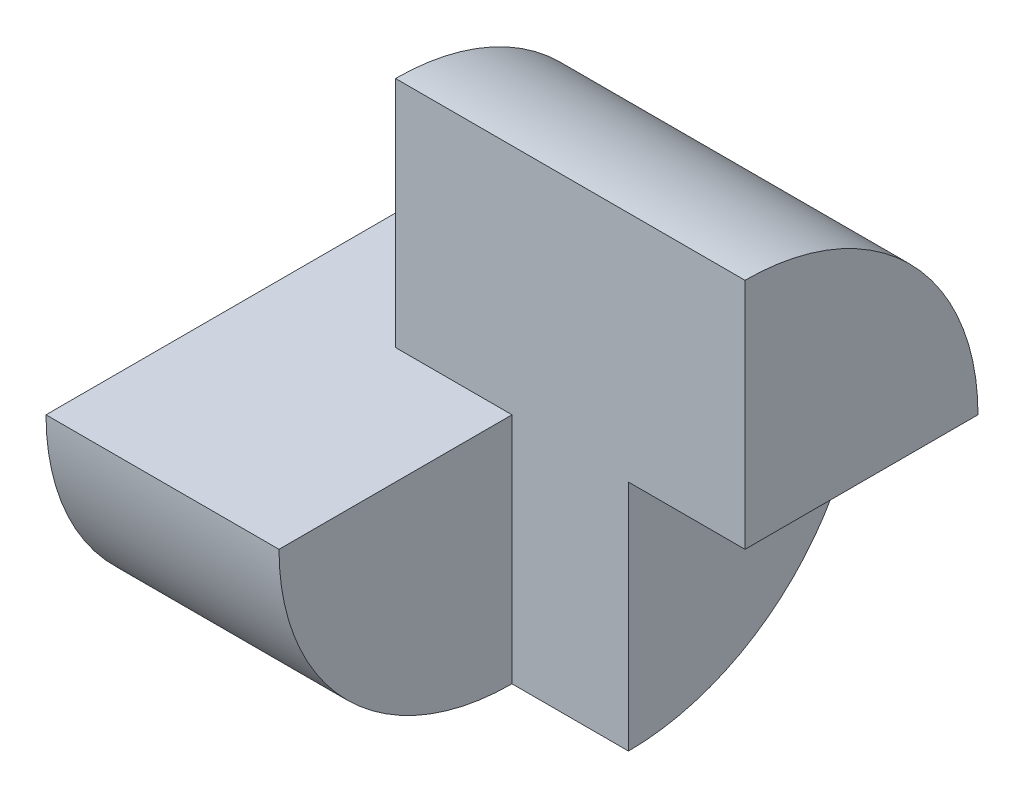
ISO-10303-21;
HEADER;
FILE_DESCRIPTION(('STEP AP214'),'2;1');
FILE_NAME('part.step','',(''),(''),'','','');
FILE_SCHEMA(('AUTOMOTIVE_DESIGN { 1 0 10303 214 1 1 1 1 }'));
ENDSEC;
DATA;
#1=APPLICATION_CONTEXT('core data for automotive mechanical design processes');
#2=APPLICATION_PROTOCOL_DEFINITION('international standard','automotive_design',2000,#1);
#3=PRODUCT_CONTEXT('',#1,'mechanical');
#4=PRODUCT('Part','Part','',(#3));
#5=PRODUCT_RELATED_PRODUCT_CATEGORY('part','',(#4));
#6=PRODUCT_DEFINITION_FORMATION('','',#4);
#7=PRODUCT_DEFINITION_CONTEXT('part definition',#1,'design');
#8=PRODUCT_DEFINITION('design','',#6,#7);
#9=PRODUCT_DEFINITION_SHAPE('','',#8);
#10=(LENGTH_UNIT() NAMED_UNIT(*) SI_UNIT(.MILLI.,.METRE.));
#11=(NAMED_UNIT(*) PLANE_ANGLE_UNIT() SI_UNIT($,.RADIAN.));
#12=(NAMED_UNIT(*) SI_UNIT($,.STERADIAN.) SOLID_ANGLE_UNIT());
#13=UNCERTAINTY_MEASURE_WITH_UNIT(LENGTH_MEASURE(1.E-05),#10,'distance_accuracy_value','');
#14=(GEOMETRIC_REPRESENTATION_CONTEXT(3) GLOBAL_UNCERTAINTY_ASSIGNED_CONTEXT((#13)) GLOBAL_UNIT_ASSIGNED_CONTEXT((#10,
#11,#12)) REPRESENTATION_CONTEXT('',''));
#15=CARTESIAN_POINT('',(0.,0.,0.));
#16=DIRECTION('',(0.,0.,1.));
#17=DIRECTION('',(1.,0.,0.));
#18=AXIS2_PLACEMENT_3D('',#15,#16,#17);
#19=CARTESIAN_POINT('',(0.,20.,0.));
#20=DIRECTION('',(0.,-1.,0.));
#21=DIRECTION('',(0.,0.,-1.));
#22=AXIS2_PLACEMENT_3D('',#19,#20,#21);
#23=PLANE('',#22);
#24=DIRECTION('',(0.,0.,1.));
#25=VECTOR('',#24,1.);
#26=CARTESIAN_POINT('',(20.,20.,40.));
#27=LINE('',#26,#25);
#28=CARTESIAN_POINT('',(20.,20.,20.));
#29=VERTEX_POINT('',#28);
#30=CARTESIAN_POINT('',(20.,20.,40.));
#31=VERTEX_POINT('',#30);
#32=EDGE_CURVE('E164',#29,#31,#27,.T.);
#33=ORIENTED_EDGE('',*,*,#32,.F.);
#34=DIRECTION('',(-1.,0.,0.));
#35=VECTOR('',#34,1.);
#36=CARTESIAN_POINT('',(50.,20.,20.));
#37=LINE('',#36,#35);
#38=CARTESIAN_POINT('',(10.,20.,20.));
#39=VERTEX_POINT('',#38);
#40=EDGE_CURVE('E149',#29,#39,#37,.T.);
#41=ORIENTED_EDGE('',*,*,#40,.T.);
#42=DIRECTION('',(0.,0.,1.));
#43=VECTOR('',#42,1.);
#44=CARTESIAN_POINT('',(10.,20.,0.));
#45=LINE('',#44,#43);
#46=CARTESIAN_POINT('',(10.,20.,0.));
#47=VERTEX_POINT('',#46);
#48=EDGE_CURVE('E127',#47,#39,#45,.T.);
#49=ORIENTED_EDGE('',*,*,#48,.F.);
#50=DIRECTION('',(1.,0.,0.));
#51=VECTOR('',#50,1.);
#52=CARTESIAN_POINT('',(0.,20.,0.));
#53=LINE('',#52,#51);
#54=CARTESIAN_POINT('',(0.,20.,0.));
#55=VERTEX_POINT('',#54);
#56=EDGE_CURVE('E123',#55,#47,#53,.T.);
#57=ORIENTED_EDGE('',*,*,#56,.F.);
#58=DIRECTION('',(0.,0.,1.));
#59=VECTOR('',#58,1.);
#60=CARTESIAN_POINT('',(0.,20.,0.));
#61=LINE('',#60,#59);
#62=CARTESIAN_POINT('',(0.,20.,40.));
#63=VERTEX_POINT('',#62);
#64=EDGE_CURVE('E110',#55,#63,#61,.T.);
#65=ORIENTED_EDGE('',*,*,#64,.T.);
#66=DIRECTION('',(1.,0.,0.));
#67=VECTOR('',#66,1.);
#68=CARTESIAN_POINT('',(0.,20.,40.));
#69=LINE('',#68,#67);
#70=EDGE_CURVE('E116',#63,#31,#69,.T.);
#71=ORIENTED_EDGE('',*,*,#70,.T.);
#72=EDGE_LOOP('',(#33,#41,#49,#57,#65,#71));
#73=FACE_BOUND('',#72,.T.);
#74=ADVANCED_FACE('F51',(#73),#23,.F.);
#75=CARTESIAN_POINT('',(0.,0.,40.));
#76=DIRECTION('',(1.,0.,0.));
#77=DIRECTION('',(0.,0.,-1.));
#78=AXIS2_PLACEMENT_3D('',#75,#76,#77);
#79=PLANE('',#78);
#80=CARTESIAN_POINT('',(0.,20.,20.));
#81=DIRECTION('',(-1.,0.,0.));
#82=DIRECTION('',(0.,0.,1.));
#83=AXIS2_PLACEMENT_3D('',#80,#81,#82);
#84=CIRCLE('',#83,20.);
#85=EDGE_CURVE('E107',#63,#55,#84,.F.);
#86=ORIENTED_EDGE('',*,*,#85,.F.);
#87=ORIENTED_EDGE('',*,*,#64,.F.);
#88=EDGE_LOOP('',(#86,#87));
#89=FACE_BOUND('',#88,.T.);
#90=ADVANCED_FACE('F53',(#89),#79,.F.);
#91=CARTESIAN_POINT('',(40.,0.,40.));
#92=DIRECTION('',(-1.,0.,0.));
#93=DIRECTION('',(0.,0.,1.));
#94=AXIS2_PLACEMENT_3D('',#91,#92,#93);
#95=PLANE('',#94);
#96=DIRECTION('',(0.,0.,1.));
#97=VECTOR('',#96,1.);
#98=CARTESIAN_POINT('',(40.,20.,0.));
#99=LINE('',#98,#97);
#100=CARTESIAN_POINT('',(40.,20.,0.));
#101=VERTEX_POINT('',#100);
#102=CARTESIAN_POINT('',(40.,20.,20.));
#103=VERTEX_POINT('',#102);
#104=EDGE_CURVE('E139',#101,#103,#99,.T.);
#105=ORIENTED_EDGE('',*,*,#104,.F.);
#106=CARTESIAN_POINT('',(40.,20.,20.));
#107=DIRECTION('',(-1.,0.,0.));
#108=DIRECTION('',(0.,0.,1.));
#109=AXIS2_PLACEMENT_3D('',#106,#107,#108);
#110=CIRCLE('',#109,20.);
#111=CARTESIAN_POINT('',(40.,40.,20.));
#112=VERTEX_POINT('',#111);
#113=EDGE_CURVE('E157',#101,#112,#110,.F.);
#114=ORIENTED_EDGE('',*,*,#113,.T.);
#115=DIRECTION('',(0.,-1.,0.));
#116=VECTOR('',#115,1.);
#117=CARTESIAN_POINT('',(40.,0.,20.));
#118=LINE('',#117,#116);
#119=EDGE_CURVE('E147',#112,#103,#118,.T.);
#120=ORIENTED_EDGE('',*,*,#119,.T.);
#121=EDGE_LOOP('',(#105,#114,#120));
#122=FACE_BOUND('',#121,.T.);
#123=ADVANCED_FACE('F179',(#122),#95,.F.);
#124=CARTESIAN_POINT('',(10.,40.,0.));
#125=DIRECTION('',(1.,0.,0.));
#126=DIRECTION('',(0.,1.,0.));
#127=AXIS2_PLACEMENT_3D('',#124,#125,#126);
#128=PLANE('',#127);
#129=DIRECTION('',(0.,-1.,0.));
#130=VECTOR('',#129,1.);
#131=CARTESIAN_POINT('',(10.,40.,20.));
#132=LINE('',#131,#130);
#133=CARTESIAN_POINT('',(10.,40.,20.));
#134=VERTEX_POINT('',#133);
#135=EDGE_CURVE('E153',#134,#39,#132,.T.);
#136=ORIENTED_EDGE('',*,*,#135,.F.);
#137=CARTESIAN_POINT('',(10.,20.,20.));
#138=DIRECTION('',(1.,0.,0.));
#139=DIRECTION('',(0.,1.,0.));
#140=AXIS2_PLACEMENT_3D('',#137,#138,#139);
#141=CIRCLE('',#140,20.);
#142=EDGE_CURVE('E160',#47,#134,#141,.T.);
#143=ORIENTED_EDGE('',*,*,#142,.F.);
#144=ORIENTED_EDGE('',*,*,#48,.T.);
#145=EDGE_LOOP('',(#136,#143,#144));
#146=FACE_BOUND('',#145,.T.);
#147=ADVANCED_FACE('F177',(#146),#128,.F.);
#148=CARTESIAN_POINT('',(30.,0.,0.));
#149=DIRECTION('',(-1.,0.,0.));
#150=DIRECTION('',(0.,0.,1.));
#151=AXIS2_PLACEMENT_3D('',#148,#149,#150);
#152=PLANE('',#151);
#153=DIRECTION('',(0.,1.,0.));
#154=VECTOR('',#153,1.);
#155=CARTESIAN_POINT('',(30.,20.,20.));
#156=LINE('',#155,#154);
#157=CARTESIAN_POINT('',(30.,0.,20.));
#158=VERTEX_POINT('',#157);
#159=CARTESIAN_POINT('',(30.,20.,20.));
#160=VERTEX_POINT('',#159);
#161=EDGE_CURVE('E66',#158,#160,#156,.T.);
#162=ORIENTED_EDGE('',*,*,#161,.F.);
#163=CARTESIAN_POINT('',(30.,20.,20.));
#164=DIRECTION('',(-1.,0.,0.));
#165=DIRECTION('',(0.,0.,1.));
#166=AXIS2_PLACEMENT_3D('',#163,#164,#165);
#167=CIRCLE('',#166,20.);
#168=CARTESIAN_POINT('',(30.,20.,0.));
#169=VERTEX_POINT('',#168);
#170=EDGE_CURVE('E113',#158,#169,#167,.F.);
#171=ORIENTED_EDGE('',*,*,#170,.T.);
#172=DIRECTION('',(0.,0.,1.));
#173=VECTOR('',#172,1.);
#174=CARTESIAN_POINT('',(30.,20.,0.));
#175=LINE('',#174,#173);
#176=EDGE_CURVE('E124',#169,#160,#175,.T.);
#177=ORIENTED_EDGE('',*,*,#176,.T.);
#178=EDGE_LOOP('',(#162,#171,#177));
#179=FACE_BOUND('',#178,.T.);
#180=ADVANCED_FACE('F141',(#179),#152,.F.);
#181=CARTESIAN_POINT('',(40.,20.,0.));
#182=DIRECTION('',(0.,1.,0.));
#183=DIRECTION('',(0.,0.,1.));
#184=AXIS2_PLACEMENT_3D('',#181,#182,#183);
#185=PLANE('',#184);
#186=ORIENTED_EDGE('',*,*,#104,.T.);
#187=DIRECTION('',(-1.,0.,0.));
#188=VECTOR('',#187,1.);
#189=CARTESIAN_POINT('',(40.,20.,20.));
#190=LINE('',#189,#188);
#191=EDGE_CURVE('E59',#103,#160,#190,.T.);
#192=ORIENTED_EDGE('',*,*,#191,.T.);
#193=ORIENTED_EDGE('',*,*,#176,.F.);
#194=DIRECTION('',(-1.,0.,0.));
#195=VECTOR('',#194,1.);
#196=CARTESIAN_POINT('',(40.,20.,0.));
#197=LINE('',#196,#195);
#198=EDGE_CURVE('E143',#101,#169,#197,.T.);
#199=ORIENTED_EDGE('',*,*,#198,.F.);
#200=EDGE_LOOP('',(#186,#192,#193,#199));
#201=FACE_BOUND('',#200,.T.);
#202=ADVANCED_FACE('F136',(#201),#185,.F.);
#203=CARTESIAN_POINT('',(50.,40.,20.));
#204=DIRECTION('',(0.,0.,-1.));
#205=DIRECTION('',(0.,1.,0.));
#206=AXIS2_PLACEMENT_3D('',#203,#204,#205);
#207=PLANE('',#206);
#208=DIRECTION('',(-1.,0.,0.));
#209=VECTOR('',#208,1.);
#210=CARTESIAN_POINT('',(50.,40.,20.));
#211=LINE('',#210,#209);
#212=EDGE_CURVE('E150',#112,#134,#211,.T.);
#213=ORIENTED_EDGE('',*,*,#212,.T.);
#214=ORIENTED_EDGE('',*,*,#135,.T.);
#215=ORIENTED_EDGE('',*,*,#40,.F.);
#216=DIRECTION('',(0.,1.,0.));
#217=VECTOR('',#216,1.);
#218=CARTESIAN_POINT('',(20.,20.,20.));
#219=LINE('',#218,#217);
#220=CARTESIAN_POINT('',(20.,0.,20.));
#221=VERTEX_POINT('',#220);
#222=EDGE_CURVE('E166',#221,#29,#219,.T.);
#223=ORIENTED_EDGE('',*,*,#222,.F.);
#224=DIRECTION('',(1.,0.,0.));
#225=VECTOR('',#224,1.);
#226=CARTESIAN_POINT('',(20.,0.,20.));
#227=LINE('',#226,#225);
#228=EDGE_CURVE('E162',#221,#158,#227,.T.);
#229=ORIENTED_EDGE('',*,*,#228,.T.);
#230=ORIENTED_EDGE('',*,*,#161,.T.);
#231=ORIENTED_EDGE('',*,*,#191,.F.);
#232=ORIENTED_EDGE('',*,*,#119,.F.);
#233=EDGE_LOOP('',(#213,#214,#215,#223,#229,#230,#231,#232));
#234=FACE_BOUND('',#233,.T.);
#235=ADVANCED_FACE('F173',(#234),#207,.F.);
#236=CARTESIAN_POINT('',(50.,20.,20.));
#237=DIRECTION('',(-1.,0.,0.));
#238=DIRECTION('',(0.,-1.,0.));
#239=AXIS2_PLACEMENT_3D('',#236,#237,#238);
#240=CYLINDRICAL_SURFACE('',#239,20.);
#241=ORIENTED_EDGE('',*,*,#198,.T.);
#242=ORIENTED_EDGE('',*,*,#170,.F.);
#243=ORIENTED_EDGE('',*,*,#228,.F.);
#244=CARTESIAN_POINT('',(20.,20.,20.));
#245=DIRECTION('',(1.,0.,0.));
#246=DIRECTION('',(0.,0.,-1.));
#247=AXIS2_PLACEMENT_3D('',#244,#245,#246);
#248=CIRCLE('',#247,20.);
#249=EDGE_CURVE('E12',#221,#31,#248,.F.);
#250=ORIENTED_EDGE('',*,*,#249,.T.);
#251=ORIENTED_EDGE('',*,*,#70,.F.);
#252=ORIENTED_EDGE('',*,*,#85,.T.);
#253=ORIENTED_EDGE('',*,*,#56,.T.);
#254=ORIENTED_EDGE('',*,*,#142,.T.);
#255=ORIENTED_EDGE('',*,*,#212,.F.);
#256=ORIENTED_EDGE('',*,*,#113,.F.);
#257=EDGE_LOOP('',(#241,#242,#243,#250,#251,#252,#253,#254,#255,#256));
#258=FACE_BOUND('',#257,.T.);
#259=ADVANCED_FACE('F118',(#258),#240,.T.);
#260=CARTESIAN_POINT('',(20.,0.,0.));
#261=DIRECTION('',(1.,0.,0.));
#262=DIRECTION('',(0.,0.,-1.));
#263=AXIS2_PLACEMENT_3D('',#260,#261,#262);
#264=PLANE('',#263);
#265=ORIENTED_EDGE('',*,*,#249,.F.);
#266=ORIENTED_EDGE('',*,*,#222,.T.);
#267=ORIENTED_EDGE('',*,*,#32,.T.);
#268=EDGE_LOOP('',(#265,#266,#267));
#269=FACE_BOUND('',#268,.T.);
#270=ADVANCED_FACE('F171',(#269),#264,.T.);
#271=CLOSED_SHELL('',(#74,#90,#123,#147,#180,#202,#235,#259,#270));
#272=MANIFOLD_SOLID_BREP('B2',#271);
#273=ADVANCED_BREP_SHAPE_REPRESENTATION('',(#18,#272),#14);
#274=SHAPE_DEFINITION_REPRESENTATION(#9,#273);
ENDSEC;
END-ISO-10303-21;
